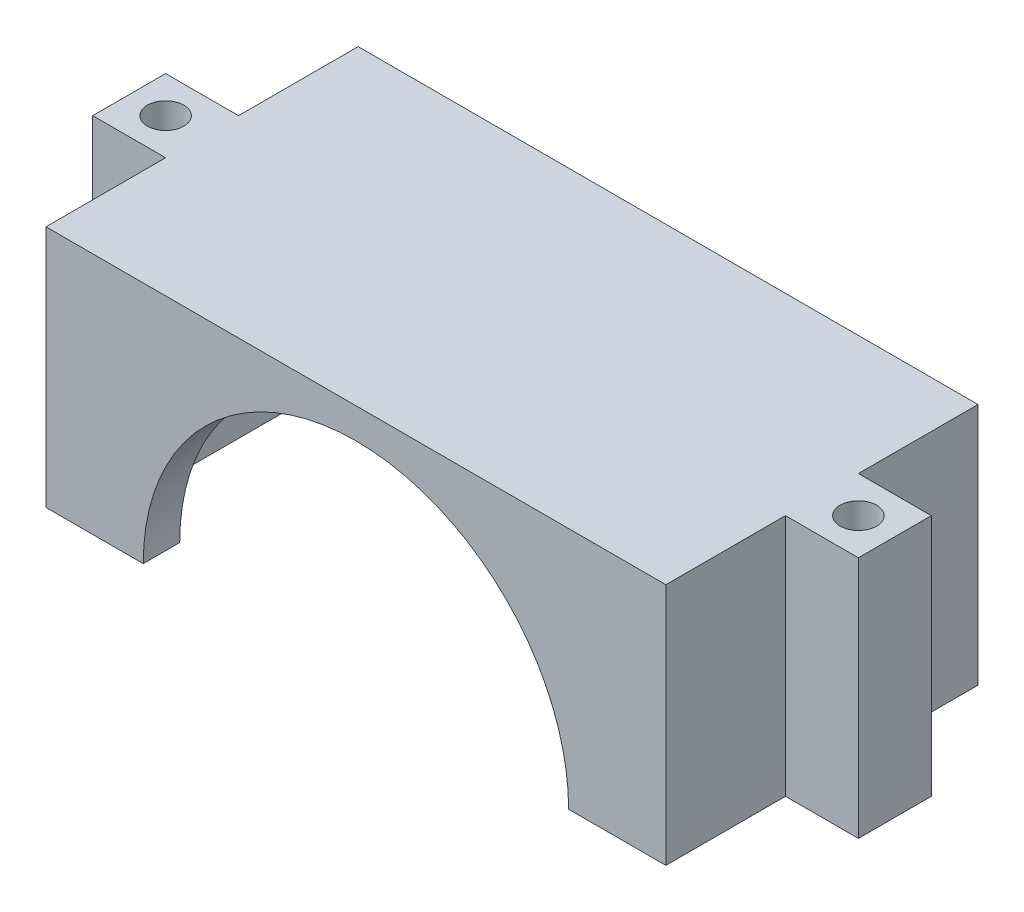
ISO-10303-21;
HEADER;
FILE_DESCRIPTION(('STEP AP214'),'2;1');
FILE_NAME('part.step','',(''),(''),'','','');
FILE_SCHEMA(('AUTOMOTIVE_DESIGN { 1 0 10303 214 1 1 1 1 }'));
ENDSEC;
DATA;
#1=APPLICATION_CONTEXT('core data for automotive mechanical design processes');
#2=APPLICATION_PROTOCOL_DEFINITION('international standard','automotive_design',2000,#1);
#3=PRODUCT_CONTEXT('',#1,'mechanical');
#4=PRODUCT('Part','Part','',(#3));
#5=PRODUCT_RELATED_PRODUCT_CATEGORY('part','',(#4));
#6=PRODUCT_DEFINITION_FORMATION('','',#4);
#7=PRODUCT_DEFINITION_CONTEXT('part definition',#1,'design');
#8=PRODUCT_DEFINITION('design','',#6,#7);
#9=PRODUCT_DEFINITION_SHAPE('','',#8);
#10=(LENGTH_UNIT() NAMED_UNIT(*) SI_UNIT(.MILLI.,.METRE.));
#11=(NAMED_UNIT(*) PLANE_ANGLE_UNIT() SI_UNIT($,.RADIAN.));
#12=(NAMED_UNIT(*) SI_UNIT($,.STERADIAN.) SOLID_ANGLE_UNIT());
#13=UNCERTAINTY_MEASURE_WITH_UNIT(LENGTH_MEASURE(1.E-05),#10,'distance_accuracy_value','');
#14=(GEOMETRIC_REPRESENTATION_CONTEXT(3) GLOBAL_UNCERTAINTY_ASSIGNED_CONTEXT((#13)) GLOBAL_UNIT_ASSIGNED_CONTEXT((#10,
#11,#12)) REPRESENTATION_CONTEXT('',''));
#15=CARTESIAN_POINT('',(0.,0.,0.));
#16=DIRECTION('',(0.,0.,1.));
#17=DIRECTION('',(1.,0.,0.));
#18=AXIS2_PLACEMENT_3D('',#15,#16,#17);
#19=CARTESIAN_POINT('',(-25.5,20.,12.84));
#20=DIRECTION('',(1.,0.,0.));
#21=DIRECTION('',(0.,0.,-1.));
#22=AXIS2_PLACEMENT_3D('',#19,#20,#21);
#23=PLANE('',#22);
#24=DIRECTION('',(0.,-1.,0.));
#25=VECTOR('',#24,1.);
#26=CARTESIAN_POINT('',(-25.5,20.,-3.00000000000001));
#27=LINE('',#26,#25);
#28=CARTESIAN_POINT('',(-25.5,20.,-3.00000000000001));
#29=VERTEX_POINT('',#28);
#30=CARTESIAN_POINT('',(-25.5,0.,-3.00000000000001));
#31=VERTEX_POINT('',#30);
#32=EDGE_CURVE('E304',#29,#31,#27,.T.);
#33=ORIENTED_EDGE('',*,*,#32,.F.);
#34=DIRECTION('',(0.,0.,1.));
#35=VECTOR('',#34,1.);
#36=CARTESIAN_POINT('',(-25.5,20.,12.84));
#37=LINE('',#36,#35);
#38=CARTESIAN_POINT('',(-25.5,20.,-12.84));
#39=VERTEX_POINT('',#38);
#40=EDGE_CURVE('E211',#39,#29,#37,.T.);
#41=ORIENTED_EDGE('',*,*,#40,.F.);
#42=DIRECTION('',(0.,-1.,0.));
#43=VECTOR('',#42,1.);
#44=CARTESIAN_POINT('',(-25.5,20.,-12.84));
#45=LINE('',#44,#43);
#46=CARTESIAN_POINT('',(-25.5,0.,-12.84));
#47=VERTEX_POINT('',#46);
#48=EDGE_CURVE('E42',#39,#47,#45,.T.);
#49=ORIENTED_EDGE('',*,*,#48,.T.);
#50=DIRECTION('',(0.,0.,1.));
#51=VECTOR('',#50,1.);
#52=CARTESIAN_POINT('',(-25.5,0.,12.84));
#53=LINE('',#52,#51);
#54=EDGE_CURVE('E255',#47,#31,#53,.T.);
#55=ORIENTED_EDGE('',*,*,#54,.T.);
#56=EDGE_LOOP('',(#33,#41,#49,#55));
#57=FACE_BOUND('',#56,.T.);
#58=ADVANCED_FACE('F33',(#57),#23,.F.);
#59=CARTESIAN_POINT('',(25.5,20.,12.84));
#60=DIRECTION('',(-1.,0.,0.));
#61=DIRECTION('',(0.,0.,1.));
#62=AXIS2_PLACEMENT_3D('',#59,#60,#61);
#63=PLANE('',#62);
#64=DIRECTION('',(0.,-1.,0.));
#65=VECTOR('',#64,1.);
#66=CARTESIAN_POINT('',(25.5,20.,3.));
#67=LINE('',#66,#65);
#68=CARTESIAN_POINT('',(25.5,20.,3.));
#69=VERTEX_POINT('',#68);
#70=CARTESIAN_POINT('',(25.5,0.,3.));
#71=VERTEX_POINT('',#70);
#72=EDGE_CURVE('E271',#69,#71,#67,.T.);
#73=ORIENTED_EDGE('',*,*,#72,.F.);
#74=DIRECTION('',(0.,0.,-1.));
#75=VECTOR('',#74,1.);
#76=CARTESIAN_POINT('',(25.5,20.,12.84));
#77=LINE('',#76,#75);
#78=CARTESIAN_POINT('',(25.5,20.,12.84));
#79=VERTEX_POINT('',#78);
#80=EDGE_CURVE('E217',#79,#69,#77,.T.);
#81=ORIENTED_EDGE('',*,*,#80,.F.);
#82=DIRECTION('',(0.,-1.,0.));
#83=VECTOR('',#82,1.);
#84=CARTESIAN_POINT('',(25.5,20.,12.84));
#85=LINE('',#84,#83);
#86=CARTESIAN_POINT('',(25.5,0.,12.84));
#87=VERTEX_POINT('',#86);
#88=EDGE_CURVE('E228',#79,#87,#85,.T.);
#89=ORIENTED_EDGE('',*,*,#88,.T.);
#90=DIRECTION('',(0.,0.,-1.));
#91=VECTOR('',#90,1.);
#92=CARTESIAN_POINT('',(25.5,0.,12.84));
#93=LINE('',#92,#91);
#94=EDGE_CURVE('E238',#87,#71,#93,.T.);
#95=ORIENTED_EDGE('',*,*,#94,.T.);
#96=EDGE_LOOP('',(#73,#81,#89,#95));
#97=FACE_BOUND('',#96,.T.);
#98=ADVANCED_FACE('F422',(#97),#63,.F.);
#99=CARTESIAN_POINT('',(0.,0.,0.));
#100=DIRECTION('',(0.,-1.,0.));
#101=DIRECTION('',(0.,0.,-1.));
#102=AXIS2_PLACEMENT_3D('',#99,#100,#101);
#103=PLANE('',#102);
#104=DIRECTION('',(0.,0.,-1.));
#105=VECTOR('',#104,1.);
#106=CARTESIAN_POINT('',(22.,0.,1.8219037896906));
#107=LINE('',#106,#105);
#108=CARTESIAN_POINT('',(22.,0.,-9.84));
#109=VERTEX_POINT('',#108);
#110=CARTESIAN_POINT('',(22.,0.,-12.84));
#111=VERTEX_POINT('',#110);
#112=EDGE_CURVE('E438',#109,#111,#107,.T.);
#113=ORIENTED_EDGE('',*,*,#112,.T.);
#114=DIRECTION('',(-1.,0.,0.));
#115=VECTOR('',#114,1.);
#116=CARTESIAN_POINT('',(-25.5,0.,-12.84));
#117=LINE('',#116,#115);
#118=CARTESIAN_POINT('',(25.5,0.,-12.84));
#119=VERTEX_POINT('',#118);
#120=EDGE_CURVE('E231',#119,#111,#117,.T.);
#121=ORIENTED_EDGE('',*,*,#120,.F.);
#122=CARTESIAN_POINT('',(25.5,0.,-3.));
#123=VERTEX_POINT('',#122);
#124=EDGE_CURVE('E235',#123,#119,#93,.T.);
#125=ORIENTED_EDGE('',*,*,#124,.F.);
#126=DIRECTION('',(1.,0.,0.));
#127=VECTOR('',#126,1.);
#128=CARTESIAN_POINT('',(25.5,0.,-3.));
#129=LINE('',#128,#127);
#130=CARTESIAN_POINT('',(31.5,0.,-3.));
#131=VERTEX_POINT('',#130);
#132=EDGE_CURVE('E58',#123,#131,#129,.T.);
#133=ORIENTED_EDGE('',*,*,#132,.T.);
#134=DIRECTION('',(0.,0.,1.));
#135=VECTOR('',#134,1.);
#136=CARTESIAN_POINT('',(31.5,0.,-3.));
#137=LINE('',#136,#135);
#138=CARTESIAN_POINT('',(31.5,0.,3.));
#139=VERTEX_POINT('',#138);
#140=EDGE_CURVE('E264',#131,#139,#137,.T.);
#141=ORIENTED_EDGE('',*,*,#140,.T.);
#142=DIRECTION('',(-1.,0.,0.));
#143=VECTOR('',#142,1.);
#144=CARTESIAN_POINT('',(25.5,0.,3.));
#145=LINE('',#144,#143);
#146=EDGE_CURVE('E260',#139,#71,#145,.T.);
#147=ORIENTED_EDGE('',*,*,#146,.T.);
#148=ORIENTED_EDGE('',*,*,#94,.F.);
#149=DIRECTION('',(1.,0.,0.));
#150=VECTOR('',#149,1.);
#151=CARTESIAN_POINT('',(-25.5,0.,12.84));
#152=LINE('',#151,#150);
#153=CARTESIAN_POINT('',(17.5,0.,12.84));
#154=VERTEX_POINT('',#153);
#155=EDGE_CURVE('E250',#154,#87,#152,.T.);
#156=ORIENTED_EDGE('',*,*,#155,.F.);
#157=DIRECTION('',(0.,0.,1.));
#158=VECTOR('',#157,1.);
#159=CARTESIAN_POINT('',(17.5,0.,-29.2911896062463));
#160=LINE('',#159,#158);
#161=CARTESIAN_POINT('',(17.5,0.,9.84));
#162=VERTEX_POINT('',#161);
#163=EDGE_CURVE('E373',#162,#154,#160,.T.);
#164=ORIENTED_EDGE('',*,*,#163,.F.);
#165=DIRECTION('',(-1.,0.,0.));
#166=VECTOR('',#165,1.);
#167=CARTESIAN_POINT('',(-22.5,0.,9.84));
#168=LINE('',#167,#166);
#169=CARTESIAN_POINT('',(22.5,0.,9.84));
#170=VERTEX_POINT('',#169);
#171=EDGE_CURVE('E399',#170,#162,#168,.T.);
#172=ORIENTED_EDGE('',*,*,#171,.F.);
#173=DIRECTION('',(0.,0.,1.));
#174=VECTOR('',#173,1.);
#175=CARTESIAN_POINT('',(22.5,0.,-9.84));
#176=LINE('',#175,#174);
#177=CARTESIAN_POINT('',(22.5,0.,-9.84));
#178=VERTEX_POINT('',#177);
#179=EDGE_CURVE('E396',#178,#170,#176,.T.);
#180=ORIENTED_EDGE('',*,*,#179,.F.);
#181=DIRECTION('',(1.,0.,0.));
#182=VECTOR('',#181,1.);
#183=CARTESIAN_POINT('',(-22.5,0.,-9.84));
#184=LINE('',#183,#182);
#185=EDGE_CURVE('E405',#109,#178,#184,.T.);
#186=ORIENTED_EDGE('',*,*,#185,.F.);
#187=EDGE_LOOP('',(#113,#121,#125,#133,#141,#147,#148,#156,#164,#172,#180,#186));
#188=FACE_BOUND('',#187,.T.);
#189=CARTESIAN_POINT('',(28.5,0.,0.));
#190=DIRECTION('',(0.,-1.,0.));
#191=DIRECTION('',(0.,0.,-1.));
#192=AXIS2_PLACEMENT_3D('',#189,#190,#191);
#193=CIRCLE('',#192,1.5);
#194=CARTESIAN_POINT('',(28.5,0.,-1.49999999999999));
#195=VERTEX_POINT('',#194);
#196=EDGE_CURVE('E300',#195,#195,#193,.T.);
#197=ORIENTED_EDGE('',*,*,#196,.F.);
#198=EDGE_LOOP('',(#197));
#199=FACE_BOUND('',#198,.T.);
#200=ADVANCED_FACE('F430',(#188,#199),#103,.T.);
#201=CARTESIAN_POINT('',(-22.5,17.5,9.84));
#202=DIRECTION('',(0.,0.,1.));
#203=DIRECTION('',(1.,0.,0.));
#204=AXIS2_PLACEMENT_3D('',#201,#202,#203);
#205=PLANE('',#204);
#206=ORIENTED_EDGE('',*,*,#171,.T.);
#207=CARTESIAN_POINT('',(0.,0.,9.84));
#208=DIRECTION('',(0.,0.,1.));
#209=DIRECTION('',(1.,0.,0.));
#210=AXIS2_PLACEMENT_3D('',#207,#208,#209);
#211=CIRCLE('',#210,17.5);
#212=CARTESIAN_POINT('',(0.,17.5,9.84));
#213=VERTEX_POINT('',#212);
#214=EDGE_CURVE('E376',#213,#162,#211,.F.);
#215=ORIENTED_EDGE('',*,*,#214,.F.);
#216=DIRECTION('',(-1.,0.,0.));
#217=VECTOR('',#216,1.);
#218=CARTESIAN_POINT('',(-22.5,17.5,9.84));
#219=LINE('',#218,#217);
#220=CARTESIAN_POINT('',(22.5,17.5,9.84));
#221=VERTEX_POINT('',#220);
#222=EDGE_CURVE('E386',#221,#213,#219,.T.);
#223=ORIENTED_EDGE('',*,*,#222,.F.);
#224=DIRECTION('',(0.,-1.,0.));
#225=VECTOR('',#224,1.);
#226=CARTESIAN_POINT('',(22.5,17.5,9.84));
#227=LINE('',#226,#225);
#228=EDGE_CURVE('E395',#221,#170,#227,.T.);
#229=ORIENTED_EDGE('',*,*,#228,.T.);
#230=EDGE_LOOP('',(#206,#215,#223,#229));
#231=FACE_BOUND('',#230,.T.);
#232=ADVANCED_FACE('F458',(#231),#205,.F.);
#233=CARTESIAN_POINT('',(25.5,20.,-3.));
#234=VERTEX_POINT('',#233);
#235=CARTESIAN_POINT('',(25.5,20.,-12.84));
#236=VERTEX_POINT('',#235);
#237=EDGE_CURVE('E249',#234,#236,#77,.T.);
#238=ORIENTED_EDGE('',*,*,#237,.F.);
#239=DIRECTION('',(0.,-1.,0.));
#240=VECTOR('',#239,1.);
#241=CARTESIAN_POINT('',(25.5,20.,-3.));
#242=LINE('',#241,#240);
#243=EDGE_CURVE('E269',#234,#123,#242,.T.);
#244=ORIENTED_EDGE('',*,*,#243,.T.);
#245=ORIENTED_EDGE('',*,*,#124,.T.);
#246=DIRECTION('',(0.,-1.,0.));
#247=VECTOR('',#246,1.);
#248=CARTESIAN_POINT('',(25.5,20.,-12.84));
#249=LINE('',#248,#247);
#250=EDGE_CURVE('E11',#236,#119,#249,.T.);
#251=ORIENTED_EDGE('',*,*,#250,.F.);
#252=EDGE_LOOP('',(#238,#244,#245,#251));
#253=FACE_BOUND('',#252,.T.);
#254=ADVANCED_FACE('F35',(#253),#63,.F.);
#255=CARTESIAN_POINT('',(-25.5,20.,-12.84));
#256=DIRECTION('',(0.,0.,1.));
#257=DIRECTION('',(1.,0.,0.));
#258=AXIS2_PLACEMENT_3D('',#255,#256,#257);
#259=PLANE('',#258);
#260=ORIENTED_EDGE('',*,*,#120,.T.);
#261=DIRECTION('',(0.,-1.,0.));
#262=VECTOR('',#261,1.);
#263=CARTESIAN_POINT('',(22.,0.,-12.84));
#264=LINE('',#263,#262);
#265=CARTESIAN_POINT('',(22.,6.,-12.84));
#266=VERTEX_POINT('',#265);
#267=EDGE_CURVE('E274',#266,#111,#264,.T.);
#268=ORIENTED_EDGE('',*,*,#267,.F.);
#269=DIRECTION('',(1.,0.,0.));
#270=VECTOR('',#269,1.);
#271=CARTESIAN_POINT('',(22.,6.,-12.84));
#272=LINE('',#271,#270);
#273=CARTESIAN_POINT('',(12.,6.,-12.84));
#274=VERTEX_POINT('',#273);
#275=EDGE_CURVE('E442',#274,#266,#272,.T.);
#276=ORIENTED_EDGE('',*,*,#275,.F.);
#277=DIRECTION('',(0.,1.,0.));
#278=VECTOR('',#277,1.);
#279=CARTESIAN_POINT('',(12.,0.,-12.84));
#280=LINE('',#279,#278);
#281=CARTESIAN_POINT('',(12.,0.,-12.84));
#282=VERTEX_POINT('',#281);
#283=EDGE_CURVE('E447',#282,#274,#280,.T.);
#284=ORIENTED_EDGE('',*,*,#283,.F.);
#285=EDGE_CURVE('E240',#282,#47,#117,.T.);
#286=ORIENTED_EDGE('',*,*,#285,.T.);
#287=ORIENTED_EDGE('',*,*,#48,.F.);
#288=DIRECTION('',(-1.,0.,0.));
#289=VECTOR('',#288,1.);
#290=CARTESIAN_POINT('',(-25.5,20.,-12.84));
#291=LINE('',#290,#289);
#292=EDGE_CURVE('E212',#236,#39,#291,.T.);
#293=ORIENTED_EDGE('',*,*,#292,.F.);
#294=ORIENTED_EDGE('',*,*,#250,.T.);
#295=EDGE_LOOP('',(#260,#268,#276,#284,#286,#287,#293,#294));
#296=FACE_BOUND('',#295,.T.);
#297=ADVANCED_FACE('F353',(#296),#259,.F.);
#298=CARTESIAN_POINT('',(-25.5,20.,2.99999999999999));
#299=VERTEX_POINT('',#298);
#300=CARTESIAN_POINT('',(-25.5,20.,12.84));
#301=VERTEX_POINT('',#300);
#302=EDGE_CURVE('E200',#299,#301,#37,.T.);
#303=ORIENTED_EDGE('',*,*,#302,.F.);
#304=DIRECTION('',(0.,-1.,0.));
#305=VECTOR('',#304,1.);
#306=CARTESIAN_POINT('',(-25.5,20.,2.99999999999999));
#307=LINE('',#306,#305);
#308=CARTESIAN_POINT('',(-25.5,0.,2.99999999999999));
#309=VERTEX_POINT('',#308);
#310=EDGE_CURVE('E185',#299,#309,#307,.T.);
#311=ORIENTED_EDGE('',*,*,#310,.T.);
#312=CARTESIAN_POINT('',(-25.5,0.,12.84));
#313=VERTEX_POINT('',#312);
#314=EDGE_CURVE('E253',#309,#313,#53,.T.);
#315=ORIENTED_EDGE('',*,*,#314,.T.);
#316=DIRECTION('',(0.,-1.,0.));
#317=VECTOR('',#316,1.);
#318=CARTESIAN_POINT('',(-25.5,20.,12.84));
#319=LINE('',#318,#317);
#320=EDGE_CURVE('E209',#301,#313,#319,.T.);
#321=ORIENTED_EDGE('',*,*,#320,.F.);
#322=EDGE_LOOP('',(#303,#311,#315,#321));
#323=FACE_BOUND('',#322,.T.);
#324=ADVANCED_FACE('F207',(#323),#23,.F.);
#325=CARTESIAN_POINT('',(-25.5,20.,12.84));
#326=DIRECTION('',(0.,0.,-1.));
#327=DIRECTION('',(-1.,0.,0.));
#328=AXIS2_PLACEMENT_3D('',#325,#326,#327);
#329=PLANE('',#328);
#330=CARTESIAN_POINT('',(-17.5,0.,12.84));
#331=VERTEX_POINT('',#330);
#332=EDGE_CURVE('E247',#313,#331,#152,.T.);
#333=ORIENTED_EDGE('',*,*,#332,.T.);
#334=CARTESIAN_POINT('',(0.,0.,12.84));
#335=DIRECTION('',(0.,0.,1.));
#336=DIRECTION('',(1.,0.,0.));
#337=AXIS2_PLACEMENT_3D('',#334,#335,#336);
#338=CIRCLE('',#337,17.5);
#339=EDGE_CURVE('E374',#154,#331,#338,.T.);
#340=ORIENTED_EDGE('',*,*,#339,.F.);
#341=ORIENTED_EDGE('',*,*,#155,.T.);
#342=ORIENTED_EDGE('',*,*,#88,.F.);
#343=DIRECTION('',(1.,0.,0.));
#344=VECTOR('',#343,1.);
#345=CARTESIAN_POINT('',(-25.5,20.,12.84));
#346=LINE('',#345,#344);
#347=EDGE_CURVE('E215',#301,#79,#346,.T.);
#348=ORIENTED_EDGE('',*,*,#347,.F.);
#349=ORIENTED_EDGE('',*,*,#320,.T.);
#350=EDGE_LOOP('',(#333,#340,#341,#342,#348,#349));
#351=FACE_BOUND('',#350,.T.);
#352=ADVANCED_FACE('F363',(#351),#329,.F.);
#353=CARTESIAN_POINT('',(0.,20.,0.));
#354=DIRECTION('',(0.,-1.,0.));
#355=DIRECTION('',(0.,0.,-1.));
#356=AXIS2_PLACEMENT_3D('',#353,#354,#355);
#357=PLANE('',#356);
#358=ORIENTED_EDGE('',*,*,#80,.T.);
#359=DIRECTION('',(-1.,0.,0.));
#360=VECTOR('',#359,1.);
#361=CARTESIAN_POINT('',(25.5,20.,3.));
#362=LINE('',#361,#360);
#363=CARTESIAN_POINT('',(31.5,20.,3.));
#364=VERTEX_POINT('',#363);
#365=EDGE_CURVE('E267',#364,#69,#362,.T.);
#366=ORIENTED_EDGE('',*,*,#365,.F.);
#367=DIRECTION('',(0.,0.,1.));
#368=VECTOR('',#367,1.);
#369=CARTESIAN_POINT('',(31.5,20.,-3.));
#370=LINE('',#369,#368);
#371=CARTESIAN_POINT('',(31.5,20.,-3.));
#372=VERTEX_POINT('',#371);
#373=EDGE_CURVE('E270',#372,#364,#370,.T.);
#374=ORIENTED_EDGE('',*,*,#373,.F.);
#375=DIRECTION('',(1.,0.,0.));
#376=VECTOR('',#375,1.);
#377=CARTESIAN_POINT('',(25.5,20.,-3.));
#378=LINE('',#377,#376);
#379=EDGE_CURVE('E263',#234,#372,#378,.T.);
#380=ORIENTED_EDGE('',*,*,#379,.F.);
#381=ORIENTED_EDGE('',*,*,#237,.T.);
#382=ORIENTED_EDGE('',*,*,#292,.T.);
#383=ORIENTED_EDGE('',*,*,#40,.T.);
#384=DIRECTION('',(1.,0.,0.));
#385=VECTOR('',#384,1.);
#386=CARTESIAN_POINT('',(-25.5,20.,-3.00000000000001));
#387=LINE('',#386,#385);
#388=CARTESIAN_POINT('',(-31.5,20.,-3.00000000000001));
#389=VERTEX_POINT('',#388);
#390=EDGE_CURVE('E193',#389,#29,#387,.T.);
#391=ORIENTED_EDGE('',*,*,#390,.F.);
#392=DIRECTION('',(0.,0.,-1.));
#393=VECTOR('',#392,1.);
#394=CARTESIAN_POINT('',(-31.5,20.,-3.00000000000001));
#395=LINE('',#394,#393);
#396=CARTESIAN_POINT('',(-31.5,20.,2.99999999999999));
#397=VERTEX_POINT('',#396);
#398=EDGE_CURVE('E204',#397,#389,#395,.T.);
#399=ORIENTED_EDGE('',*,*,#398,.F.);
#400=DIRECTION('',(-1.,0.,0.));
#401=VECTOR('',#400,1.);
#402=CARTESIAN_POINT('',(-25.5,20.,2.99999999999999));
#403=LINE('',#402,#401);
#404=EDGE_CURVE('E188',#299,#397,#403,.T.);
#405=ORIENTED_EDGE('',*,*,#404,.F.);
#406=ORIENTED_EDGE('',*,*,#302,.T.);
#407=ORIENTED_EDGE('',*,*,#347,.T.);
#408=EDGE_LOOP('',(#358,#366,#374,#380,#381,#382,#383,#391,#399,#405,#406,#407));
#409=FACE_BOUND('',#408,.T.);
#410=CARTESIAN_POINT('',(28.5,20.,0.));
#411=DIRECTION('',(0.,-1.,0.));
#412=DIRECTION('',(0.,0.,-1.));
#413=AXIS2_PLACEMENT_3D('',#410,#411,#412);
#414=CIRCLE('',#413,1.5);
#415=CARTESIAN_POINT('',(28.5,20.,-1.49999999999999));
#416=VERTEX_POINT('',#415);
#417=EDGE_CURVE('E303',#416,#416,#414,.T.);
#418=ORIENTED_EDGE('',*,*,#417,.T.);
#419=EDGE_LOOP('',(#418));
#420=FACE_BOUND('',#419,.T.);
#421=CARTESIAN_POINT('',(-28.5,20.,0.));
#422=DIRECTION('',(0.,-1.,0.));
#423=DIRECTION('',(0.,0.,1.));
#424=AXIS2_PLACEMENT_3D('',#421,#422,#423);
#425=CIRCLE('',#424,1.5);
#426=CARTESIAN_POINT('',(-28.5,20.,1.5));
#427=VERTEX_POINT('',#426);
#428=EDGE_CURVE('E333',#427,#427,#425,.T.);
#429=ORIENTED_EDGE('',*,*,#428,.T.);
#430=EDGE_LOOP('',(#429));
#431=FACE_BOUND('',#430,.T.);
#432=ADVANCED_FACE('F198',(#409,#420,#431),#357,.F.);
#433=DIRECTION('',(0.,0.,-1.));
#434=VECTOR('',#433,1.);
#435=CARTESIAN_POINT('',(12.,0.,1.8219037896906));
#436=LINE('',#435,#434);
#437=CARTESIAN_POINT('',(12.,0.,-9.84));
#438=VERTEX_POINT('',#437);
#439=EDGE_CURVE('E358',#438,#282,#436,.T.);
#440=ORIENTED_EDGE('',*,*,#439,.F.);
#441=CARTESIAN_POINT('',(-22.5,0.,-9.84));
#442=VERTEX_POINT('',#441);
#443=EDGE_CURVE('E385',#442,#438,#184,.T.);
#444=ORIENTED_EDGE('',*,*,#443,.F.);
#445=DIRECTION('',(0.,0.,-1.));
#446=VECTOR('',#445,1.);
#447=CARTESIAN_POINT('',(-22.5,0.,-9.84));
#448=LINE('',#447,#446);
#449=CARTESIAN_POINT('',(-22.5,0.,9.84));
#450=VERTEX_POINT('',#449);
#451=EDGE_CURVE('E402',#450,#442,#448,.T.);
#452=ORIENTED_EDGE('',*,*,#451,.F.);
#453=CARTESIAN_POINT('',(-17.5,0.,9.84));
#454=VERTEX_POINT('',#453);
#455=EDGE_CURVE('E370',#454,#450,#168,.T.);
#456=ORIENTED_EDGE('',*,*,#455,.F.);
#457=DIRECTION('',(0.,0.,1.));
#458=VECTOR('',#457,1.);
#459=CARTESIAN_POINT('',(-17.5,0.,-29.2911896062463));
#460=LINE('',#459,#458);
#461=EDGE_CURVE('E368',#454,#331,#460,.T.);
#462=ORIENTED_EDGE('',*,*,#461,.T.);
#463=ORIENTED_EDGE('',*,*,#332,.F.);
#464=ORIENTED_EDGE('',*,*,#314,.F.);
#465=DIRECTION('',(-1.,0.,0.));
#466=VECTOR('',#465,1.);
#467=CARTESIAN_POINT('',(-25.5,0.,2.99999999999999));
#468=LINE('',#467,#466);
#469=CARTESIAN_POINT('',(-31.5,0.,2.99999999999999));
#470=VERTEX_POINT('',#469);
#471=EDGE_CURVE('E50',#309,#470,#468,.T.);
#472=ORIENTED_EDGE('',*,*,#471,.T.);
#473=DIRECTION('',(0.,0.,-1.));
#474=VECTOR('',#473,1.);
#475=CARTESIAN_POINT('',(-31.5,0.,-3.00000000000001));
#476=LINE('',#475,#474);
#477=CARTESIAN_POINT('',(-31.5,0.,-3.00000000000001));
#478=VERTEX_POINT('',#477);
#479=EDGE_CURVE('E320',#470,#478,#476,.T.);
#480=ORIENTED_EDGE('',*,*,#479,.T.);
#481=DIRECTION('',(1.,0.,0.));
#482=VECTOR('',#481,1.);
#483=CARTESIAN_POINT('',(-25.5,0.,-3.00000000000001));
#484=LINE('',#483,#482);
#485=EDGE_CURVE('E205',#478,#31,#484,.T.);
#486=ORIENTED_EDGE('',*,*,#485,.T.);
#487=ORIENTED_EDGE('',*,*,#54,.F.);
#488=ORIENTED_EDGE('',*,*,#285,.F.);
#489=EDGE_LOOP('',(#440,#444,#452,#456,#462,#463,#464,#472,#480,#486,#487,#488));
#490=FACE_BOUND('',#489,.T.);
#491=CARTESIAN_POINT('',(-28.5,0.,0.));
#492=DIRECTION('',(0.,-1.,0.));
#493=DIRECTION('',(0.,0.,1.));
#494=AXIS2_PLACEMENT_3D('',#491,#492,#493);
#495=CIRCLE('',#494,1.5);
#496=CARTESIAN_POINT('',(-28.5,0.,1.5));
#497=VERTEX_POINT('',#496);
#498=EDGE_CURVE('E335',#497,#497,#495,.T.);
#499=ORIENTED_EDGE('',*,*,#498,.F.);
#500=EDGE_LOOP('',(#499));
#501=FACE_BOUND('',#500,.T.);
#502=ADVANCED_FACE('F330',(#490,#501),#103,.T.);
#503=CARTESIAN_POINT('',(22.5,17.5,-9.84));
#504=DIRECTION('',(1.,0.,0.));
#505=DIRECTION('',(0.,0.,-1.));
#506=AXIS2_PLACEMENT_3D('',#503,#504,#505);
#507=PLANE('',#506);
#508=ORIENTED_EDGE('',*,*,#179,.T.);
#509=ORIENTED_EDGE('',*,*,#228,.F.);
#510=DIRECTION('',(0.,0.,1.));
#511=VECTOR('',#510,1.);
#512=CARTESIAN_POINT('',(22.5,17.5,-9.84));
#513=LINE('',#512,#511);
#514=CARTESIAN_POINT('',(22.5,17.5,-9.84));
#515=VERTEX_POINT('',#514);
#516=EDGE_CURVE('E381',#515,#221,#513,.T.);
#517=ORIENTED_EDGE('',*,*,#516,.F.);
#518=DIRECTION('',(0.,-1.,0.));
#519=VECTOR('',#518,1.);
#520=CARTESIAN_POINT('',(22.5,17.5,-9.84));
#521=LINE('',#520,#519);
#522=EDGE_CURVE('E407',#515,#178,#521,.T.);
#523=ORIENTED_EDGE('',*,*,#522,.T.);
#524=EDGE_LOOP('',(#508,#509,#517,#523));
#525=FACE_BOUND('',#524,.T.);
#526=ADVANCED_FACE('F461',(#525),#507,.F.);
#527=CARTESIAN_POINT('',(-22.5,17.5,-9.84));
#528=DIRECTION('',(0.,0.,-1.));
#529=DIRECTION('',(-1.,0.,0.));
#530=AXIS2_PLACEMENT_3D('',#527,#528,#529);
#531=PLANE('',#530);
#532=DIRECTION('',(-1.,0.,0.));
#533=VECTOR('',#532,1.);
#534=CARTESIAN_POINT('',(22.,6.,-9.84));
#535=LINE('',#534,#533);
#536=CARTESIAN_POINT('',(22.,6.,-9.84));
#537=VERTEX_POINT('',#536);
#538=CARTESIAN_POINT('',(12.,6.,-9.84));
#539=VERTEX_POINT('',#538);
#540=EDGE_CURVE('E468',#537,#539,#535,.T.);
#541=ORIENTED_EDGE('',*,*,#540,.F.);
#542=DIRECTION('',(0.,1.,0.));
#543=VECTOR('',#542,1.);
#544=CARTESIAN_POINT('',(22.,0.,-9.84));
#545=LINE('',#544,#543);
#546=EDGE_CURVE('E378',#109,#537,#545,.T.);
#547=ORIENTED_EDGE('',*,*,#546,.F.);
#548=ORIENTED_EDGE('',*,*,#185,.T.);
#549=ORIENTED_EDGE('',*,*,#522,.F.);
#550=DIRECTION('',(1.,0.,0.));
#551=VECTOR('',#550,1.);
#552=CARTESIAN_POINT('',(-22.5,17.5,-9.84));
#553=LINE('',#552,#551);
#554=CARTESIAN_POINT('',(-22.5,17.5,-9.84));
#555=VERTEX_POINT('',#554);
#556=EDGE_CURVE('E392',#555,#515,#553,.T.);
#557=ORIENTED_EDGE('',*,*,#556,.F.);
#558=DIRECTION('',(0.,-1.,0.));
#559=VECTOR('',#558,1.);
#560=CARTESIAN_POINT('',(-22.5,17.5,-9.84));
#561=LINE('',#560,#559);
#562=EDGE_CURVE('E410',#555,#442,#561,.T.);
#563=ORIENTED_EDGE('',*,*,#562,.T.);
#564=ORIENTED_EDGE('',*,*,#443,.T.);
#565=DIRECTION('',(0.,-1.,0.));
#566=VECTOR('',#565,1.);
#567=CARTESIAN_POINT('',(12.,0.,-9.84));
#568=LINE('',#567,#566);
#569=EDGE_CURVE('E287',#539,#438,#568,.T.);
#570=ORIENTED_EDGE('',*,*,#569,.F.);
#571=EDGE_LOOP('',(#541,#547,#548,#549,#557,#563,#564,#570));
#572=FACE_BOUND('',#571,.T.);
#573=ADVANCED_FACE('F465',(#572),#531,.F.);
#574=CARTESIAN_POINT('',(-22.5,17.5,-9.84));
#575=DIRECTION('',(-1.,0.,0.));
#576=DIRECTION('',(0.,0.,1.));
#577=AXIS2_PLACEMENT_3D('',#574,#575,#576);
#578=PLANE('',#577);
#579=ORIENTED_EDGE('',*,*,#451,.T.);
#580=ORIENTED_EDGE('',*,*,#562,.F.);
#581=DIRECTION('',(0.,0.,-1.));
#582=VECTOR('',#581,1.);
#583=CARTESIAN_POINT('',(-22.5,17.5,-9.84));
#584=LINE('',#583,#582);
#585=CARTESIAN_POINT('',(-22.5,17.5,9.84));
#586=VERTEX_POINT('',#585);
#587=EDGE_CURVE('E389',#586,#555,#584,.T.);
#588=ORIENTED_EDGE('',*,*,#587,.F.);
#589=DIRECTION('',(0.,-1.,0.));
#590=VECTOR('',#589,1.);
#591=CARTESIAN_POINT('',(-22.5,17.5,9.84));
#592=LINE('',#591,#590);
#593=EDGE_CURVE('E412',#586,#450,#592,.T.);
#594=ORIENTED_EDGE('',*,*,#593,.T.);
#595=EDGE_LOOP('',(#579,#580,#588,#594));
#596=FACE_BOUND('',#595,.T.);
#597=ADVANCED_FACE('F518',(#596),#578,.F.);
#598=EDGE_CURVE('E384',#213,#586,#219,.T.);
#599=ORIENTED_EDGE('',*,*,#598,.F.);
#600=EDGE_CURVE('E398',#454,#213,#211,.F.);
#601=ORIENTED_EDGE('',*,*,#600,.F.);
#602=ORIENTED_EDGE('',*,*,#455,.T.);
#603=ORIENTED_EDGE('',*,*,#593,.F.);
#604=EDGE_LOOP('',(#599,#601,#602,#603));
#605=FACE_BOUND('',#604,.T.);
#606=ADVANCED_FACE('F510',(#605),#205,.F.);
#607=CARTESIAN_POINT('',(0.,17.5,0.));
#608=DIRECTION('',(0.,1.,0.));
#609=DIRECTION('',(0.,0.,1.));
#610=AXIS2_PLACEMENT_3D('',#607,#608,#609);
#611=PLANE('',#610);
#612=ORIENTED_EDGE('',*,*,#516,.T.);
#613=ORIENTED_EDGE('',*,*,#222,.T.);
#614=ORIENTED_EDGE('',*,*,#598,.T.);
#615=ORIENTED_EDGE('',*,*,#587,.T.);
#616=ORIENTED_EDGE('',*,*,#556,.T.);
#617=EDGE_LOOP('',(#612,#613,#614,#615,#616));
#618=FACE_BOUND('',#617,.T.);
#619=ADVANCED_FACE('F489',(#618),#611,.F.);
#620=CARTESIAN_POINT('',(0.,0.,-29.2911896062463));
#621=DIRECTION('',(0.,0.,1.));
#622=DIRECTION('',(1.,0.,0.));
#623=AXIS2_PLACEMENT_3D('',#620,#621,#622);
#624=CYLINDRICAL_SURFACE('',#623,17.5);
#625=ORIENTED_EDGE('',*,*,#600,.T.);
#626=ORIENTED_EDGE('',*,*,#214,.T.);
#627=ORIENTED_EDGE('',*,*,#163,.T.);
#628=ORIENTED_EDGE('',*,*,#339,.T.);
#629=ORIENTED_EDGE('',*,*,#461,.F.);
#630=EDGE_LOOP('',(#625,#626,#627,#628,#629));
#631=FACE_BOUND('',#630,.T.);
#632=ADVANCED_FACE('F453',(#631),#624,.F.);
#633=CARTESIAN_POINT('',(22.,0.,1.8219037896906));
#634=DIRECTION('',(1.,0.,0.));
#635=DIRECTION('',(0.,0.,-1.));
#636=AXIS2_PLACEMENT_3D('',#633,#634,#635);
#637=PLANE('',#636);
#638=ORIENTED_EDGE('',*,*,#546,.T.);
#639=DIRECTION('',(0.,0.,-1.));
#640=VECTOR('',#639,1.);
#641=CARTESIAN_POINT('',(22.,6.,1.8219037896906));
#642=LINE('',#641,#640);
#643=EDGE_CURVE('E475',#537,#266,#642,.T.);
#644=ORIENTED_EDGE('',*,*,#643,.T.);
#645=ORIENTED_EDGE('',*,*,#267,.T.);
#646=ORIENTED_EDGE('',*,*,#112,.F.);
#647=EDGE_LOOP('',(#638,#644,#645,#646));
#648=FACE_BOUND('',#647,.T.);
#649=ADVANCED_FACE('F481',(#648),#637,.F.);
#650=CARTESIAN_POINT('',(22.,6.,1.8219037896906));
#651=DIRECTION('',(0.,1.,0.));
#652=DIRECTION('',(0.,0.,1.));
#653=AXIS2_PLACEMENT_3D('',#650,#651,#652);
#654=PLANE('',#653);
#655=ORIENTED_EDGE('',*,*,#540,.T.);
#656=DIRECTION('',(0.,0.,-1.));
#657=VECTOR('',#656,1.);
#658=CARTESIAN_POINT('',(12.,6.,1.8219037896906));
#659=LINE('',#658,#657);
#660=EDGE_CURVE('E444',#539,#274,#659,.T.);
#661=ORIENTED_EDGE('',*,*,#660,.T.);
#662=ORIENTED_EDGE('',*,*,#275,.T.);
#663=ORIENTED_EDGE('',*,*,#643,.F.);
#664=EDGE_LOOP('',(#655,#661,#662,#663));
#665=FACE_BOUND('',#664,.T.);
#666=ADVANCED_FACE('F477',(#665),#654,.F.);
#667=CARTESIAN_POINT('',(12.,0.,1.8219037896906));
#668=DIRECTION('',(-1.,0.,0.));
#669=DIRECTION('',(0.,0.,1.));
#670=AXIS2_PLACEMENT_3D('',#667,#668,#669);
#671=PLANE('',#670);
#672=ORIENTED_EDGE('',*,*,#569,.T.);
#673=ORIENTED_EDGE('',*,*,#439,.T.);
#674=ORIENTED_EDGE('',*,*,#283,.T.);
#675=ORIENTED_EDGE('',*,*,#660,.F.);
#676=EDGE_LOOP('',(#672,#673,#674,#675));
#677=FACE_BOUND('',#676,.T.);
#678=ADVANCED_FACE('F480',(#677),#671,.F.);
#679=CARTESIAN_POINT('',(25.5,20.,3.));
#680=DIRECTION('',(0.,0.,1.));
#681=DIRECTION('',(1.,0.,0.));
#682=AXIS2_PLACEMENT_3D('',#679,#680,#681);
#683=PLANE('',#682);
#684=ORIENTED_EDGE('',*,*,#146,.F.);
#685=DIRECTION('',(0.,-1.,0.));
#686=VECTOR('',#685,1.);
#687=CARTESIAN_POINT('',(31.5,20.,3.));
#688=LINE('',#687,#686);
#689=EDGE_CURVE('E275',#364,#139,#688,.T.);
#690=ORIENTED_EDGE('',*,*,#689,.F.);
#691=ORIENTED_EDGE('',*,*,#365,.T.);
#692=ORIENTED_EDGE('',*,*,#72,.T.);
#693=EDGE_LOOP('',(#684,#690,#691,#692));
#694=FACE_BOUND('',#693,.T.);
#695=ADVANCED_FACE('F426',(#694),#683,.T.);
#696=CARTESIAN_POINT('',(31.5,20.,-3.));
#697=DIRECTION('',(1.,0.,0.));
#698=DIRECTION('',(0.,0.,-1.));
#699=AXIS2_PLACEMENT_3D('',#696,#697,#698);
#700=PLANE('',#699);
#701=ORIENTED_EDGE('',*,*,#140,.F.);
#702=DIRECTION('',(0.,-1.,0.));
#703=VECTOR('',#702,1.);
#704=CARTESIAN_POINT('',(31.5,20.,-3.));
#705=LINE('',#704,#703);
#706=EDGE_CURVE('E283',#372,#131,#705,.T.);
#707=ORIENTED_EDGE('',*,*,#706,.F.);
#708=ORIENTED_EDGE('',*,*,#373,.T.);
#709=ORIENTED_EDGE('',*,*,#689,.T.);
#710=EDGE_LOOP('',(#701,#707,#708,#709));
#711=FACE_BOUND('',#710,.T.);
#712=ADVANCED_FACE('F435',(#711),#700,.T.);
#713=CARTESIAN_POINT('',(25.5,20.,-3.));
#714=DIRECTION('',(0.,0.,-1.));
#715=DIRECTION('',(-1.,0.,0.));
#716=AXIS2_PLACEMENT_3D('',#713,#714,#715);
#717=PLANE('',#716);
#718=ORIENTED_EDGE('',*,*,#132,.F.);
#719=ORIENTED_EDGE('',*,*,#243,.F.);
#720=ORIENTED_EDGE('',*,*,#379,.T.);
#721=ORIENTED_EDGE('',*,*,#706,.T.);
#722=EDGE_LOOP('',(#718,#719,#720,#721));
#723=FACE_BOUND('',#722,.T.);
#724=ADVANCED_FACE('F568',(#723),#717,.T.);
#725=CARTESIAN_POINT('',(28.5,20.,0.));
#726=DIRECTION('',(0.,-1.,0.));
#727=DIRECTION('',(0.,0.,-1.));
#728=AXIS2_PLACEMENT_3D('',#725,#726,#727);
#729=CYLINDRICAL_SURFACE('',#728,1.5);
#730=ORIENTED_EDGE('',*,*,#417,.F.);
#731=EDGE_LOOP('',(#730));
#732=FACE_BOUND('',#731,.T.);
#733=ORIENTED_EDGE('',*,*,#196,.T.);
#734=EDGE_LOOP('',(#733));
#735=FACE_BOUND('',#734,.T.);
#736=ADVANCED_FACE('F577',(#732,#735),#729,.F.);
#737=CARTESIAN_POINT('',(-25.5,20.,-3.00000000000001));
#738=DIRECTION('',(0.,0.,-1.));
#739=DIRECTION('',(-1.,0.,0.));
#740=AXIS2_PLACEMENT_3D('',#737,#738,#739);
#741=PLANE('',#740);
#742=ORIENTED_EDGE('',*,*,#485,.F.);
#743=DIRECTION('',(0.,-1.,0.));
#744=VECTOR('',#743,1.);
#745=CARTESIAN_POINT('',(-31.5,20.,-3.00000000000001));
#746=LINE('',#745,#744);
#747=EDGE_CURVE('E316',#389,#478,#746,.T.);
#748=ORIENTED_EDGE('',*,*,#747,.F.);
#749=ORIENTED_EDGE('',*,*,#390,.T.);
#750=ORIENTED_EDGE('',*,*,#32,.T.);
#751=EDGE_LOOP('',(#742,#748,#749,#750));
#752=FACE_BOUND('',#751,.T.);
#753=ADVANCED_FACE('F343',(#752),#741,.T.);
#754=CARTESIAN_POINT('',(-31.5,20.,-3.00000000000001));
#755=DIRECTION('',(-1.,0.,0.));
#756=DIRECTION('',(0.,0.,1.));
#757=AXIS2_PLACEMENT_3D('',#754,#755,#756);
#758=PLANE('',#757);
#759=ORIENTED_EDGE('',*,*,#479,.F.);
#760=DIRECTION('',(0.,-1.,0.));
#761=VECTOR('',#760,1.);
#762=CARTESIAN_POINT('',(-31.5,20.,2.99999999999999));
#763=LINE('',#762,#761);
#764=EDGE_CURVE('E192',#397,#470,#763,.T.);
#765=ORIENTED_EDGE('',*,*,#764,.F.);
#766=ORIENTED_EDGE('',*,*,#398,.T.);
#767=ORIENTED_EDGE('',*,*,#747,.T.);
#768=EDGE_LOOP('',(#759,#765,#766,#767));
#769=FACE_BOUND('',#768,.T.);
#770=ADVANCED_FACE('F325',(#769),#758,.T.);
#771=CARTESIAN_POINT('',(-25.5,20.,2.99999999999999));
#772=DIRECTION('',(0.,0.,1.));
#773=DIRECTION('',(1.,0.,0.));
#774=AXIS2_PLACEMENT_3D('',#771,#772,#773);
#775=PLANE('',#774);
#776=ORIENTED_EDGE('',*,*,#471,.F.);
#777=ORIENTED_EDGE('',*,*,#310,.F.);
#778=ORIENTED_EDGE('',*,*,#404,.T.);
#779=ORIENTED_EDGE('',*,*,#764,.T.);
#780=EDGE_LOOP('',(#776,#777,#778,#779));
#781=FACE_BOUND('',#780,.T.);
#782=ADVANCED_FACE('F187',(#781),#775,.T.);
#783=CARTESIAN_POINT('',(-28.5,20.,0.));
#784=DIRECTION('',(0.,-1.,0.));
#785=DIRECTION('',(0.,0.,-1.));
#786=AXIS2_PLACEMENT_3D('',#783,#784,#785);
#787=CYLINDRICAL_SURFACE('',#786,1.5);
#788=ORIENTED_EDGE('',*,*,#428,.F.);
#789=EDGE_LOOP('',(#788));
#790=FACE_BOUND('',#789,.T.);
#791=ORIENTED_EDGE('',*,*,#498,.T.);
#792=EDGE_LOOP('',(#791));
#793=FACE_BOUND('',#792,.T.);
#794=ADVANCED_FACE('F611',(#790,#793),#787,.F.);
#795=CLOSED_SHELL('',(#58,#98,#200,#232,#254,#297,#324,#352,#432,#502,#526,#573,#597,#606,#619,
#632,#649,#666,#678,#695,#712,#724,#736,#753,#770,#782,#794));
#796=MANIFOLD_SOLID_BREP('B2',#795);
#797=ADVANCED_BREP_SHAPE_REPRESENTATION('',(#18,#796),#14);
#798=SHAPE_DEFINITION_REPRESENTATION(#9,#797);
ENDSEC;
END-ISO-10303-21;
